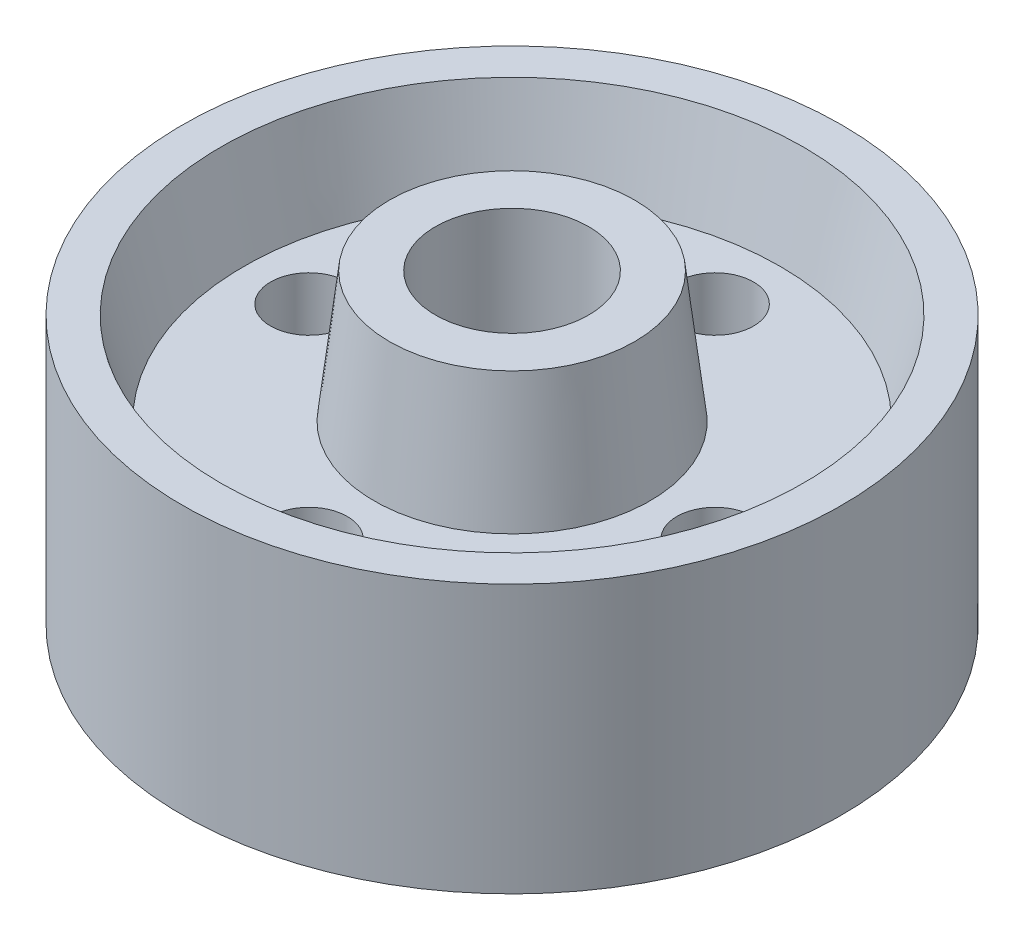
ISO-10303-21;
HEADER;
FILE_DESCRIPTION(('STEP AP214'),'2;1');
FILE_NAME('part.step','',(''),(''),'','','');
FILE_SCHEMA(('AUTOMOTIVE_DESIGN { 1 0 10303 214 1 1 1 1 }'));
ENDSEC;
DATA;
#1=APPLICATION_CONTEXT('core data for automotive mechanical design processes');
#2=APPLICATION_PROTOCOL_DEFINITION('international standard','automotive_design',2000,#1);
#3=PRODUCT_CONTEXT('',#1,'mechanical');
#4=PRODUCT('Part','Part','',(#3));
#5=PRODUCT_RELATED_PRODUCT_CATEGORY('part','',(#4));
#6=PRODUCT_DEFINITION_FORMATION('','',#4);
#7=PRODUCT_DEFINITION_CONTEXT('part definition',#1,'design');
#8=PRODUCT_DEFINITION('design','',#6,#7);
#9=PRODUCT_DEFINITION_SHAPE('','',#8);
#10=(LENGTH_UNIT() NAMED_UNIT(*) SI_UNIT(.MILLI.,.METRE.));
#11=(NAMED_UNIT(*) PLANE_ANGLE_UNIT() SI_UNIT($,.RADIAN.));
#12=(NAMED_UNIT(*) SI_UNIT($,.STERADIAN.) SOLID_ANGLE_UNIT());
#13=UNCERTAINTY_MEASURE_WITH_UNIT(LENGTH_MEASURE(1.E-05),#10,'distance_accuracy_value','');
#14=(GEOMETRIC_REPRESENTATION_CONTEXT(3) GLOBAL_UNCERTAINTY_ASSIGNED_CONTEXT((#13)) GLOBAL_UNIT_ASSIGNED_CONTEXT((#10,
#11,#12)) REPRESENTATION_CONTEXT('',''));
#15=CARTESIAN_POINT('',(0.,0.,0.));
#16=DIRECTION('',(0.,0.,1.));
#17=DIRECTION('',(1.,0.,0.));
#18=AXIS2_PLACEMENT_3D('',#15,#16,#17);
#19=CARTESIAN_POINT('',(-16.,-5.,0.));
#20=DIRECTION('',(0.,1.,0.));
#21=DIRECTION('',(0.,0.,1.));
#22=AXIS2_PLACEMENT_3D('',#19,#20,#21);
#23=PLANE('',#22);
#24=CARTESIAN_POINT('',(0.,-5.,0.));
#25=DIRECTION('',(0.,-1.,0.));
#26=DIRECTION('',(0.,0.,-1.));
#27=AXIS2_PLACEMENT_3D('',#24,#25,#26);
#28=CIRCLE('',#27,10.);
#29=CARTESIAN_POINT('',(0.,-5.,-10.));
#30=VERTEX_POINT('',#29);
#31=EDGE_CURVE('E77',#30,#30,#28,.T.);
#32=ORIENTED_EDGE('',*,*,#31,.F.);
#33=EDGE_LOOP('',(#32));
#34=FACE_BOUND('',#33,.T.);
#35=CARTESIAN_POINT('',(0.,-5.,0.));
#36=DIRECTION('',(0.,-1.,0.));
#37=DIRECTION('',(0.,0.,-1.));
#38=AXIS2_PLACEMENT_3D('',#35,#36,#37);
#39=CIRCLE('',#38,16.);
#40=CARTESIAN_POINT('',(0.,-5.,-16.));
#41=VERTEX_POINT('',#40);
#42=EDGE_CURVE('E10',#41,#41,#39,.T.);
#43=ORIENTED_EDGE('',*,*,#42,.T.);
#44=EDGE_LOOP('',(#43));
#45=FACE_BOUND('',#44,.T.);
#46=ADVANCED_FACE('F39',(#34,#45),#23,.F.);
#47=CARTESIAN_POINT('',(0.,12.,0.));
#48=DIRECTION('',(0.,1.,0.));
#49=DIRECTION('',(0.,0.,1.));
#50=AXIS2_PLACEMENT_3D('',#47,#48,#49);
#51=CONICAL_SURFACE('',#50,18.,0.117108744566864);
#52=ORIENTED_EDGE('',*,*,#42,.F.);
#53=EDGE_LOOP('',(#52));
#54=FACE_BOUND('',#53,.T.);
#55=CARTESIAN_POINT('',(0.,12.,0.));
#56=DIRECTION('',(0.,-1.,0.));
#57=DIRECTION('',(0.,0.,-1.));
#58=AXIS2_PLACEMENT_3D('',#55,#56,#57);
#59=CIRCLE('',#58,18.);
#60=CARTESIAN_POINT('',(0.,12.,-18.));
#61=VERTEX_POINT('',#60);
#62=EDGE_CURVE('E45',#61,#61,#59,.T.);
#63=ORIENTED_EDGE('',*,*,#62,.T.);
#64=EDGE_LOOP('',(#63));
#65=FACE_BOUND('',#64,.T.);
#66=ADVANCED_FACE('F143',(#54,#65),#51,.T.);
#67=CARTESIAN_POINT('',(-35.,12.,0.));
#68=DIRECTION('',(0.,1.,0.));
#69=DIRECTION('',(0.,0.,1.));
#70=AXIS2_PLACEMENT_3D('',#67,#68,#69);
#71=PLANE('',#70);
#72=CARTESIAN_POINT('',(0.,12.,26.5));
#73=DIRECTION('',(0.,1.,0.));
#74=DIRECTION('',(0.,0.,1.));
#75=AXIS2_PLACEMENT_3D('',#72,#73,#74);
#76=CIRCLE('',#75,5.);
#77=CARTESIAN_POINT('',(0.,12.,31.5));
#78=VERTEX_POINT('',#77);
#79=EDGE_CURVE('E80',#78,#78,#76,.T.);
#80=ORIENTED_EDGE('',*,*,#79,.T.);
#81=EDGE_LOOP('',(#80));
#82=FACE_BOUND('',#81,.T.);
#83=CARTESIAN_POINT('',(-26.5,12.,0.));
#84=DIRECTION('',(0.,1.,0.));
#85=DIRECTION('',(0.,0.,1.));
#86=AXIS2_PLACEMENT_3D('',#83,#84,#85);
#87=CIRCLE('',#86,5.);
#88=CARTESIAN_POINT('',(-26.5,12.,5.00000000000001));
#89=VERTEX_POINT('',#88);
#90=EDGE_CURVE('E85',#89,#89,#87,.T.);
#91=ORIENTED_EDGE('',*,*,#90,.T.);
#92=EDGE_LOOP('',(#91));
#93=FACE_BOUND('',#92,.T.);
#94=CARTESIAN_POINT('',(0.,12.,-26.5));
#95=DIRECTION('',(0.,1.,0.));
#96=DIRECTION('',(0.,0.,1.));
#97=AXIS2_PLACEMENT_3D('',#94,#95,#96);
#98=CIRCLE('',#97,5.);
#99=CARTESIAN_POINT('',(0.,12.,-21.5));
#100=VERTEX_POINT('',#99);
#101=EDGE_CURVE('E88',#100,#100,#98,.T.);
#102=ORIENTED_EDGE('',*,*,#101,.T.);
#103=EDGE_LOOP('',(#102));
#104=FACE_BOUND('',#103,.T.);
#105=CARTESIAN_POINT('',(26.5,12.,0.));
#106=DIRECTION('',(0.,1.,0.));
#107=DIRECTION('',(0.,0.,1.));
#108=AXIS2_PLACEMENT_3D('',#105,#106,#107);
#109=CIRCLE('',#108,5.);
#110=CARTESIAN_POINT('',(26.5,12.,5.));
#111=VERTEX_POINT('',#110);
#112=EDGE_CURVE('E91',#111,#111,#109,.T.);
#113=ORIENTED_EDGE('',*,*,#112,.T.);
#114=EDGE_LOOP('',(#113));
#115=FACE_BOUND('',#114,.T.);
#116=ORIENTED_EDGE('',*,*,#62,.F.);
#117=EDGE_LOOP('',(#116));
#118=FACE_BOUND('',#117,.T.);
#119=CARTESIAN_POINT('',(0.,12.,0.));
#120=DIRECTION('',(0.,-1.,0.));
#121=DIRECTION('',(0.,0.,-1.));
#122=AXIS2_PLACEMENT_3D('',#119,#120,#121);
#123=CIRCLE('',#122,35.);
#124=CARTESIAN_POINT('',(0.,12.,-35.));
#125=VERTEX_POINT('',#124);
#126=EDGE_CURVE('E49',#125,#125,#123,.T.);
#127=ORIENTED_EDGE('',*,*,#126,.T.);
#128=EDGE_LOOP('',(#127));
#129=FACE_BOUND('',#128,.T.);
#130=ADVANCED_FACE('F148',(#82,#93,#104,#115,#118,#129),#71,.F.);
#131=CARTESIAN_POINT('',(0.,0.,0.));
#132=DIRECTION('',(0.,-1.,0.));
#133=DIRECTION('',(0.,0.,-1.));
#134=AXIS2_PLACEMENT_3D('',#131,#132,#133);
#135=CONICAL_SURFACE('',#134,38.,0.244978663126864);
#136=ORIENTED_EDGE('',*,*,#126,.F.);
#137=EDGE_LOOP('',(#136));
#138=FACE_BOUND('',#137,.T.);
#139=CARTESIAN_POINT('',(0.,0.,0.));
#140=DIRECTION('',(0.,-1.,0.));
#141=DIRECTION('',(0.,0.,-1.));
#142=AXIS2_PLACEMENT_3D('',#139,#140,#141);
#143=CIRCLE('',#142,38.);
#144=CARTESIAN_POINT('',(0.,0.,-38.));
#145=VERTEX_POINT('',#144);
#146=EDGE_CURVE('E53',#145,#145,#143,.T.);
#147=ORIENTED_EDGE('',*,*,#146,.T.);
#148=EDGE_LOOP('',(#147));
#149=FACE_BOUND('',#148,.T.);
#150=ADVANCED_FACE('F156',(#138,#149),#135,.F.);
#151=CARTESIAN_POINT('',(-43.,0.,0.));
#152=DIRECTION('',(0.,1.,0.));
#153=DIRECTION('',(0.,0.,1.));
#154=AXIS2_PLACEMENT_3D('',#151,#152,#153);
#155=PLANE('',#154);
#156=ORIENTED_EDGE('',*,*,#146,.F.);
#157=EDGE_LOOP('',(#156));
#158=FACE_BOUND('',#157,.T.);
#159=CARTESIAN_POINT('',(0.,0.,0.));
#160=DIRECTION('',(0.,-1.,0.));
#161=DIRECTION('',(0.,0.,-1.));
#162=AXIS2_PLACEMENT_3D('',#159,#160,#161);
#163=CIRCLE('',#162,43.);
#164=CARTESIAN_POINT('',(0.,0.,-43.));
#165=VERTEX_POINT('',#164);
#166=EDGE_CURVE('E58',#165,#165,#163,.T.);
#167=ORIENTED_EDGE('',*,*,#166,.T.);
#168=EDGE_LOOP('',(#167));
#169=FACE_BOUND('',#168,.T.);
#170=ADVANCED_FACE('F161',(#158,#169),#155,.F.);
#171=CARTESIAN_POINT('',(0.,0.,0.));
#172=DIRECTION('',(0.,-1.,0.));
#173=DIRECTION('',(0.,0.,-1.));
#174=AXIS2_PLACEMENT_3D('',#171,#172,#173);
#175=CYLINDRICAL_SURFACE('',#174,43.);
#176=ORIENTED_EDGE('',*,*,#166,.F.);
#177=EDGE_LOOP('',(#176));
#178=FACE_BOUND('',#177,.T.);
#179=CARTESIAN_POINT('',(0.,35.,0.));
#180=DIRECTION('',(0.,-1.,0.));
#181=DIRECTION('',(0.,0.,-1.));
#182=AXIS2_PLACEMENT_3D('',#179,#180,#181);
#183=CIRCLE('',#182,43.);
#184=CARTESIAN_POINT('',(0.,35.,-43.));
#185=VERTEX_POINT('',#184);
#186=EDGE_CURVE('E61',#185,#185,#183,.T.);
#187=ORIENTED_EDGE('',*,*,#186,.T.);
#188=EDGE_LOOP('',(#187));
#189=FACE_BOUND('',#188,.T.);
#190=ADVANCED_FACE('F165',(#178,#189),#175,.T.);
#191=CARTESIAN_POINT('',(-43.,35.,0.));
#192=DIRECTION('',(0.,-1.,0.));
#193=DIRECTION('',(0.,0.,-1.));
#194=AXIS2_PLACEMENT_3D('',#191,#192,#193);
#195=PLANE('',#194);
#196=ORIENTED_EDGE('',*,*,#186,.F.);
#197=EDGE_LOOP('',(#196));
#198=FACE_BOUND('',#197,.T.);
#199=CARTESIAN_POINT('',(0.,35.,0.));
#200=DIRECTION('',(0.,-1.,0.));
#201=DIRECTION('',(0.,0.,-1.));
#202=AXIS2_PLACEMENT_3D('',#199,#200,#201);
#203=CIRCLE('',#202,38.);
#204=CARTESIAN_POINT('',(0.,35.,-38.));
#205=VERTEX_POINT('',#204);
#206=EDGE_CURVE('E64',#205,#205,#203,.T.);
#207=ORIENTED_EDGE('',*,*,#206,.T.);
#208=EDGE_LOOP('',(#207));
#209=FACE_BOUND('',#208,.T.);
#210=ADVANCED_FACE('F169',(#198,#209),#195,.F.);
#211=CARTESIAN_POINT('',(0.,23.,0.));
#212=DIRECTION('',(0.,1.,0.));
#213=DIRECTION('',(0.,0.,1.));
#214=AXIS2_PLACEMENT_3D('',#211,#212,#213);
#215=CONICAL_SURFACE('',#214,35.,0.244978663126864);
#216=ORIENTED_EDGE('',*,*,#206,.F.);
#217=EDGE_LOOP('',(#216));
#218=FACE_BOUND('',#217,.T.);
#219=CARTESIAN_POINT('',(0.,23.,0.));
#220=DIRECTION('',(0.,-1.,0.));
#221=DIRECTION('',(0.,0.,-1.));
#222=AXIS2_PLACEMENT_3D('',#219,#220,#221);
#223=CIRCLE('',#222,35.);
#224=CARTESIAN_POINT('',(0.,23.,-35.));
#225=VERTEX_POINT('',#224);
#226=EDGE_CURVE('E67',#225,#225,#223,.T.);
#227=ORIENTED_EDGE('',*,*,#226,.T.);
#228=EDGE_LOOP('',(#227));
#229=FACE_BOUND('',#228,.T.);
#230=ADVANCED_FACE('F114',(#218,#229),#215,.F.);
#231=CARTESIAN_POINT('',(-35.,23.,0.));
#232=DIRECTION('',(0.,-1.,0.));
#233=DIRECTION('',(0.,0.,-1.));
#234=AXIS2_PLACEMENT_3D('',#231,#232,#233);
#235=PLANE('',#234);
#236=CARTESIAN_POINT('',(0.,23.,26.5));
#237=DIRECTION('',(0.,1.,0.));
#238=DIRECTION('',(0.,0.,1.));
#239=AXIS2_PLACEMENT_3D('',#236,#237,#238);
#240=CIRCLE('',#239,5.);
#241=CARTESIAN_POINT('',(0.,23.,31.5));
#242=VERTEX_POINT('',#241);
#243=EDGE_CURVE('E94',#242,#242,#240,.T.);
#244=ORIENTED_EDGE('',*,*,#243,.F.);
#245=EDGE_LOOP('',(#244));
#246=FACE_BOUND('',#245,.T.);
#247=CARTESIAN_POINT('',(-26.5,23.,0.));
#248=DIRECTION('',(0.,1.,0.));
#249=DIRECTION('',(0.,0.,1.));
#250=AXIS2_PLACEMENT_3D('',#247,#248,#249);
#251=CIRCLE('',#250,5.);
#252=CARTESIAN_POINT('',(-26.5,23.,5.00000000000001));
#253=VERTEX_POINT('',#252);
#254=EDGE_CURVE('E101',#253,#253,#251,.T.);
#255=ORIENTED_EDGE('',*,*,#254,.F.);
#256=EDGE_LOOP('',(#255));
#257=FACE_BOUND('',#256,.T.);
#258=CARTESIAN_POINT('',(0.,23.,-26.5));
#259=DIRECTION('',(0.,1.,0.));
#260=DIRECTION('',(0.,0.,1.));
#261=AXIS2_PLACEMENT_3D('',#258,#259,#260);
#262=CIRCLE('',#261,5.);
#263=CARTESIAN_POINT('',(0.,23.,-21.5));
#264=VERTEX_POINT('',#263);
#265=EDGE_CURVE('E98',#264,#264,#262,.T.);
#266=ORIENTED_EDGE('',*,*,#265,.F.);
#267=EDGE_LOOP('',(#266));
#268=FACE_BOUND('',#267,.T.);
#269=CARTESIAN_POINT('',(26.5,23.,0.));
#270=DIRECTION('',(0.,1.,0.));
#271=DIRECTION('',(0.,0.,1.));
#272=AXIS2_PLACEMENT_3D('',#269,#270,#271);
#273=CIRCLE('',#272,5.);
#274=CARTESIAN_POINT('',(26.5,23.,5.));
#275=VERTEX_POINT('',#274);
#276=EDGE_CURVE('E95',#275,#275,#273,.T.);
#277=ORIENTED_EDGE('',*,*,#276,.F.);
#278=EDGE_LOOP('',(#277));
#279=FACE_BOUND('',#278,.T.);
#280=ORIENTED_EDGE('',*,*,#226,.F.);
#281=EDGE_LOOP('',(#280));
#282=FACE_BOUND('',#281,.T.);
#283=CARTESIAN_POINT('',(0.,23.,0.));
#284=DIRECTION('',(0.,-1.,0.));
#285=DIRECTION('',(0.,0.,-1.));
#286=AXIS2_PLACEMENT_3D('',#283,#284,#285);
#287=CIRCLE('',#286,18.);
#288=CARTESIAN_POINT('',(0.,23.,-18.));
#289=VERTEX_POINT('',#288);
#290=EDGE_CURVE('E70',#289,#289,#287,.T.);
#291=ORIENTED_EDGE('',*,*,#290,.T.);
#292=EDGE_LOOP('',(#291));
#293=FACE_BOUND('',#292,.T.);
#294=ADVANCED_FACE('F110',(#246,#257,#268,#279,#282,#293),#235,.F.);
#295=CARTESIAN_POINT('',(0.,40.,0.));
#296=DIRECTION('',(0.,-1.,0.));
#297=DIRECTION('',(0.,0.,-1.));
#298=AXIS2_PLACEMENT_3D('',#295,#296,#297);
#299=CONICAL_SURFACE('',#298,16.,0.117108744566864);
#300=ORIENTED_EDGE('',*,*,#290,.F.);
#301=EDGE_LOOP('',(#300));
#302=FACE_BOUND('',#301,.T.);
#303=CARTESIAN_POINT('',(0.,40.,0.));
#304=DIRECTION('',(0.,-1.,0.));
#305=DIRECTION('',(0.,0.,-1.));
#306=AXIS2_PLACEMENT_3D('',#303,#304,#305);
#307=CIRCLE('',#306,16.);
#308=CARTESIAN_POINT('',(0.,40.,-16.));
#309=VERTEX_POINT('',#308);
#310=EDGE_CURVE('E73',#309,#309,#307,.T.);
#311=ORIENTED_EDGE('',*,*,#310,.T.);
#312=EDGE_LOOP('',(#311));
#313=FACE_BOUND('',#312,.T.);
#314=ADVANCED_FACE('F113',(#302,#313),#299,.T.);
#315=CARTESIAN_POINT('',(-16.,40.,0.));
#316=DIRECTION('',(0.,-1.,0.));
#317=DIRECTION('',(0.,0.,-1.));
#318=AXIS2_PLACEMENT_3D('',#315,#316,#317);
#319=PLANE('',#318);
#320=CARTESIAN_POINT('',(0.,40.,0.));
#321=DIRECTION('',(0.,-1.,0.));
#322=DIRECTION('',(0.,0.,-1.));
#323=AXIS2_PLACEMENT_3D('',#320,#321,#322);
#324=CIRCLE('',#323,10.);
#325=CARTESIAN_POINT('',(0.,40.,-10.));
#326=VERTEX_POINT('',#325);
#327=EDGE_CURVE('E76',#326,#326,#324,.T.);
#328=ORIENTED_EDGE('',*,*,#327,.T.);
#329=EDGE_LOOP('',(#328));
#330=FACE_BOUND('',#329,.T.);
#331=ORIENTED_EDGE('',*,*,#310,.F.);
#332=EDGE_LOOP('',(#331));
#333=FACE_BOUND('',#332,.T.);
#334=ADVANCED_FACE('F128',(#330,#333),#319,.F.);
#335=CARTESIAN_POINT('',(0.,40.,0.));
#336=DIRECTION('',(0.,-1.,0.));
#337=DIRECTION('',(0.,0.,-1.));
#338=AXIS2_PLACEMENT_3D('',#335,#336,#337);
#339=CYLINDRICAL_SURFACE('',#338,10.);
#340=ORIENTED_EDGE('',*,*,#327,.F.);
#341=EDGE_LOOP('',(#340));
#342=FACE_BOUND('',#341,.T.);
#343=ORIENTED_EDGE('',*,*,#31,.T.);
#344=EDGE_LOOP('',(#343));
#345=FACE_BOUND('',#344,.T.);
#346=ADVANCED_FACE('F133',(#342,#345),#339,.F.);
#347=CARTESIAN_POINT('',(26.5,-5.,0.));
#348=DIRECTION('',(0.,1.,0.));
#349=DIRECTION('',(0.,0.,1.));
#350=AXIS2_PLACEMENT_3D('',#347,#348,#349);
#351=CYLINDRICAL_SURFACE('',#350,5.);
#352=ORIENTED_EDGE('',*,*,#276,.T.);
#353=EDGE_LOOP('',(#352));
#354=FACE_BOUND('',#353,.T.);
#355=ORIENTED_EDGE('',*,*,#112,.F.);
#356=EDGE_LOOP('',(#355));
#357=FACE_BOUND('',#356,.T.);
#358=ADVANCED_FACE('F140',(#354,#357),#351,.F.);
#359=CARTESIAN_POINT('',(0.,-5.,-26.5));
#360=DIRECTION('',(0.,1.,0.));
#361=DIRECTION('',(0.,0.,1.));
#362=AXIS2_PLACEMENT_3D('',#359,#360,#361);
#363=CYLINDRICAL_SURFACE('',#362,5.);
#364=ORIENTED_EDGE('',*,*,#265,.T.);
#365=EDGE_LOOP('',(#364));
#366=FACE_BOUND('',#365,.T.);
#367=ORIENTED_EDGE('',*,*,#101,.F.);
#368=EDGE_LOOP('',(#367));
#369=FACE_BOUND('',#368,.T.);
#370=ADVANCED_FACE('F212',(#366,#369),#363,.F.);
#371=CARTESIAN_POINT('',(-26.5,-5.,0.));
#372=DIRECTION('',(0.,1.,0.));
#373=DIRECTION('',(0.,0.,1.));
#374=AXIS2_PLACEMENT_3D('',#371,#372,#373);
#375=CYLINDRICAL_SURFACE('',#374,5.);
#376=ORIENTED_EDGE('',*,*,#254,.T.);
#377=EDGE_LOOP('',(#376));
#378=FACE_BOUND('',#377,.T.);
#379=ORIENTED_EDGE('',*,*,#90,.F.);
#380=EDGE_LOOP('',(#379));
#381=FACE_BOUND('',#380,.T.);
#382=ADVANCED_FACE('F222',(#378,#381),#375,.F.);
#383=CARTESIAN_POINT('',(0.,-5.,26.5));
#384=DIRECTION('',(0.,1.,0.));
#385=DIRECTION('',(0.,0.,1.));
#386=AXIS2_PLACEMENT_3D('',#383,#384,#385);
#387=CYLINDRICAL_SURFACE('',#386,5.);
#388=ORIENTED_EDGE('',*,*,#243,.T.);
#389=EDGE_LOOP('',(#388));
#390=FACE_BOUND('',#389,.T.);
#391=ORIENTED_EDGE('',*,*,#79,.F.);
#392=EDGE_LOOP('',(#391));
#393=FACE_BOUND('',#392,.T.);
#394=ADVANCED_FACE('F107',(#390,#393),#387,.F.);
#395=CLOSED_SHELL('',(#46,#66,#130,#150,#170,#190,#210,#230,#294,#314,#334,#346,#358,#370,#382,#394));
#396=MANIFOLD_SOLID_BREP('B2',#395);
#397=ADVANCED_BREP_SHAPE_REPRESENTATION('',(#18,#396),#14);
#398=SHAPE_DEFINITION_REPRESENTATION(#9,#397);
ENDSEC;
END-ISO-10303-21;
